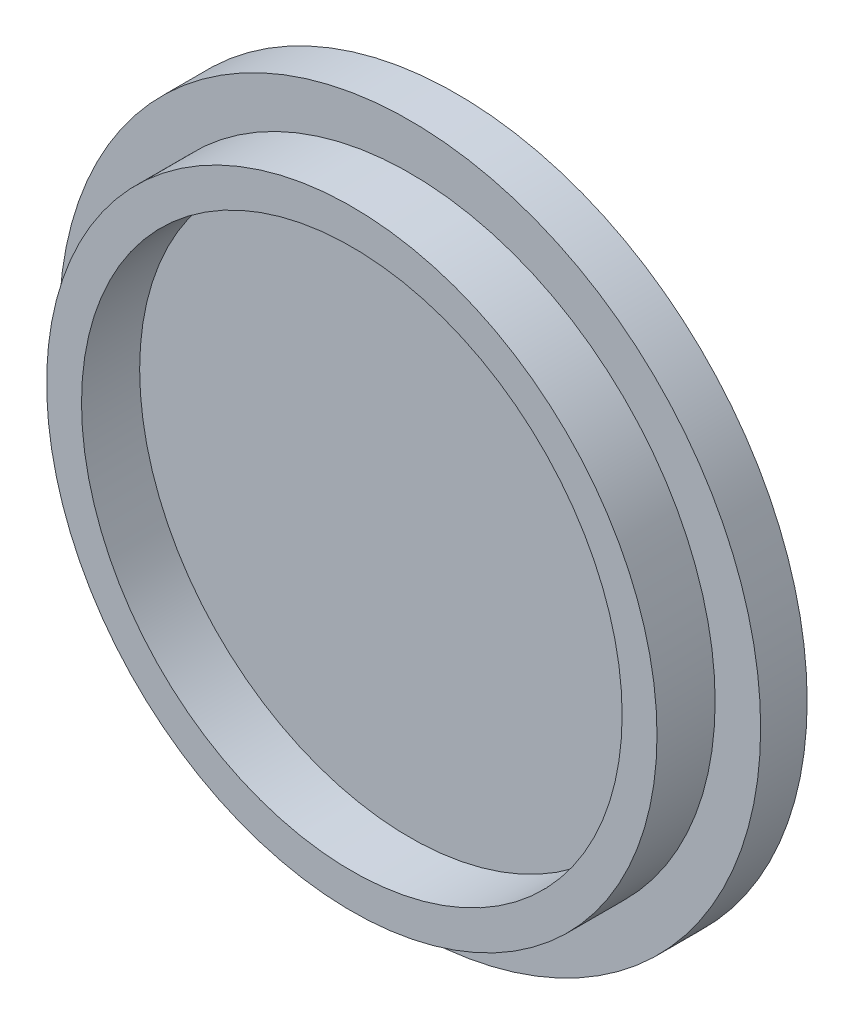
ISO-10303-21;
HEADER;
FILE_DESCRIPTION(('STEP AP214'),'2;1');
FILE_NAME('part.step','',(''),(''),'','','');
FILE_SCHEMA(('AUTOMOTIVE_DESIGN { 1 0 10303 214 1 1 1 1 }'));
ENDSEC;
DATA;
#1=APPLICATION_CONTEXT('core data for automotive mechanical design processes');
#2=APPLICATION_PROTOCOL_DEFINITION('international standard','automotive_design',2000,#1);
#3=PRODUCT_CONTEXT('',#1,'mechanical');
#4=PRODUCT('Part','Part','',(#3));
#5=PRODUCT_RELATED_PRODUCT_CATEGORY('part','',(#4));
#6=PRODUCT_DEFINITION_FORMATION('','',#4);
#7=PRODUCT_DEFINITION_CONTEXT('part definition',#1,'design');
#8=PRODUCT_DEFINITION('design','',#6,#7);
#9=PRODUCT_DEFINITION_SHAPE('','',#8);
#10=(LENGTH_UNIT() NAMED_UNIT(*) SI_UNIT(.MILLI.,.METRE.));
#11=(NAMED_UNIT(*) PLANE_ANGLE_UNIT() SI_UNIT($,.RADIAN.));
#12=(NAMED_UNIT(*) SI_UNIT($,.STERADIAN.) SOLID_ANGLE_UNIT());
#13=UNCERTAINTY_MEASURE_WITH_UNIT(LENGTH_MEASURE(1.E-05),#10,'distance_accuracy_value','');
#14=(GEOMETRIC_REPRESENTATION_CONTEXT(3) GLOBAL_UNCERTAINTY_ASSIGNED_CONTEXT((#13)) GLOBAL_UNIT_ASSIGNED_CONTEXT((#10,
#11,#12)) REPRESENTATION_CONTEXT('',''));
#15=CARTESIAN_POINT('',(0.,0.,0.));
#16=DIRECTION('',(0.,0.,1.));
#17=DIRECTION('',(1.,0.,0.));
#18=AXIS2_PLACEMENT_3D('',#15,#16,#17);
#19=CARTESIAN_POINT('',(0.,0.,-2.));
#20=DIRECTION('',(0.,0.,1.));
#21=DIRECTION('',(1.,0.,0.));
#22=AXIS2_PLACEMENT_3D('',#19,#20,#21);
#23=CYLINDRICAL_SURFACE('',#22,30.165);
#24=CARTESIAN_POINT('',(0.,0.,-2.));
#25=DIRECTION('',(0.,0.,1.));
#26=DIRECTION('',(1.,0.,0.));
#27=AXIS2_PLACEMENT_3D('',#24,#25,#26);
#28=CIRCLE('',#27,30.165);
#29=CARTESIAN_POINT('',(30.165,0.,-2.));
#30=VERTEX_POINT('',#29);
#31=EDGE_CURVE('E46',#30,#30,#28,.T.);
#32=ORIENTED_EDGE('',*,*,#31,.T.);
#33=EDGE_LOOP('',(#32));
#34=FACE_BOUND('',#33,.T.);
#35=CARTESIAN_POINT('',(0.,0.,2.));
#36=DIRECTION('',(0.,0.,1.));
#37=DIRECTION('',(1.,0.,0.));
#38=AXIS2_PLACEMENT_3D('',#35,#36,#37);
#39=CIRCLE('',#38,30.165);
#40=CARTESIAN_POINT('',(30.165,0.,2.));
#41=VERTEX_POINT('',#40);
#42=EDGE_CURVE('E51',#41,#41,#39,.T.);
#43=ORIENTED_EDGE('',*,*,#42,.F.);
#44=EDGE_LOOP('',(#43));
#45=FACE_BOUND('',#44,.T.);
#46=ADVANCED_FACE('F39',(#34,#45),#23,.T.);
#47=CARTESIAN_POINT('',(0.,0.,-2.));
#48=DIRECTION('',(0.,0.,1.));
#49=DIRECTION('',(1.,0.,0.));
#50=AXIS2_PLACEMENT_3D('',#47,#48,#49);
#51=PLANE('',#50);
#52=ORIENTED_EDGE('',*,*,#31,.F.);
#53=EDGE_LOOP('',(#52));
#54=FACE_BOUND('',#53,.T.);
#55=ADVANCED_FACE('F85',(#54),#51,.F.);
#56=CARTESIAN_POINT('',(0.,0.,2.));
#57=DIRECTION('',(0.,0.,1.));
#58=DIRECTION('',(1.,0.,0.));
#59=AXIS2_PLACEMENT_3D('',#56,#57,#58);
#60=PLANE('',#59);
#61=CARTESIAN_POINT('',(0.,0.,2.));
#62=DIRECTION('',(0.,0.,1.));
#63=DIRECTION('',(1.,0.,0.));
#64=AXIS2_PLACEMENT_3D('',#61,#62,#63);
#65=CIRCLE('',#64,26.25);
#66=CARTESIAN_POINT('',(26.25,0.,2.));
#67=VERTEX_POINT('',#66);
#68=EDGE_CURVE('E59',#67,#67,#65,.T.);
#69=ORIENTED_EDGE('',*,*,#68,.F.);
#70=EDGE_LOOP('',(#69));
#71=FACE_BOUND('',#70,.T.);
#72=ORIENTED_EDGE('',*,*,#42,.T.);
#73=EDGE_LOOP('',(#72));
#74=FACE_BOUND('',#73,.T.);
#75=ADVANCED_FACE('F76',(#71,#74),#60,.T.);
#76=CARTESIAN_POINT('',(0.,0.,7.));
#77=DIRECTION('',(0.,0.,1.));
#78=DIRECTION('',(1.,0.,0.));
#79=AXIS2_PLACEMENT_3D('',#76,#77,#78);
#80=PLANE('',#79);
#81=CARTESIAN_POINT('',(0.,0.,7.));
#82=DIRECTION('',(0.,0.,1.));
#83=DIRECTION('',(1.,0.,0.));
#84=AXIS2_PLACEMENT_3D('',#81,#82,#83);
#85=CIRCLE('',#84,26.25);
#86=CARTESIAN_POINT('',(26.25,0.,7.));
#87=VERTEX_POINT('',#86);
#88=EDGE_CURVE('E56',#87,#87,#85,.T.);
#89=ORIENTED_EDGE('',*,*,#88,.T.);
#90=EDGE_LOOP('',(#89));
#91=FACE_BOUND('',#90,.T.);
#92=CARTESIAN_POINT('',(0.,0.,7.));
#93=DIRECTION('',(0.,0.,1.));
#94=DIRECTION('',(1.,0.,0.));
#95=AXIS2_PLACEMENT_3D('',#92,#93,#94);
#96=CIRCLE('',#95,23.25);
#97=CARTESIAN_POINT('',(23.25,0.,7.));
#98=VERTEX_POINT('',#97);
#99=EDGE_CURVE('E63',#98,#98,#96,.T.);
#100=ORIENTED_EDGE('',*,*,#99,.F.);
#101=EDGE_LOOP('',(#100));
#102=FACE_BOUND('',#101,.T.);
#103=ADVANCED_FACE('F73',(#91,#102),#80,.T.);
#104=CARTESIAN_POINT('',(0.,0.,7.));
#105=DIRECTION('',(0.,0.,-1.));
#106=DIRECTION('',(-1.,0.,0.));
#107=AXIS2_PLACEMENT_3D('',#104,#105,#106);
#108=CYLINDRICAL_SURFACE('',#107,26.25);
#109=ORIENTED_EDGE('',*,*,#88,.F.);
#110=EDGE_LOOP('',(#109));
#111=FACE_BOUND('',#110,.T.);
#112=ORIENTED_EDGE('',*,*,#68,.T.);
#113=EDGE_LOOP('',(#112));
#114=FACE_BOUND('',#113,.T.);
#115=ADVANCED_FACE('F75',(#111,#114),#108,.T.);
#116=CARTESIAN_POINT('',(0.,0.,7.));
#117=DIRECTION('',(0.,0.,-1.));
#118=DIRECTION('',(-1.,0.,0.));
#119=AXIS2_PLACEMENT_3D('',#116,#117,#118);
#120=CYLINDRICAL_SURFACE('',#119,23.25);
#121=ORIENTED_EDGE('',*,*,#99,.T.);
#122=EDGE_LOOP('',(#121));
#123=FACE_BOUND('',#122,.T.);
#124=CARTESIAN_POINT('',(0.,0.,2.));
#125=DIRECTION('',(0.,0.,1.));
#126=DIRECTION('',(1.,0.,0.));
#127=AXIS2_PLACEMENT_3D('',#124,#125,#126);
#128=CIRCLE('',#127,23.25);
#129=CARTESIAN_POINT('',(23.25,0.,2.));
#130=VERTEX_POINT('',#129);
#131=EDGE_CURVE('E10',#130,#130,#128,.F.);
#132=ORIENTED_EDGE('',*,*,#131,.T.);
#133=EDGE_LOOP('',(#132));
#134=FACE_BOUND('',#133,.T.);
#135=ADVANCED_FACE('F71',(#123,#134),#120,.F.);
#136=ORIENTED_EDGE('',*,*,#131,.F.);
#137=EDGE_LOOP('',(#136));
#138=FACE_BOUND('',#137,.T.);
#139=ADVANCED_FACE('F88',(#138),#60,.T.);
#140=CLOSED_SHELL('',(#46,#55,#75,#103,#115,#135,#139));
#141=MANIFOLD_SOLID_BREP('B2',#140);
#142=ADVANCED_BREP_SHAPE_REPRESENTATION('',(#18,#141),#14);
#143=SHAPE_DEFINITION_REPRESENTATION(#9,#142);
ENDSEC;
END-ISO-10303-21;
